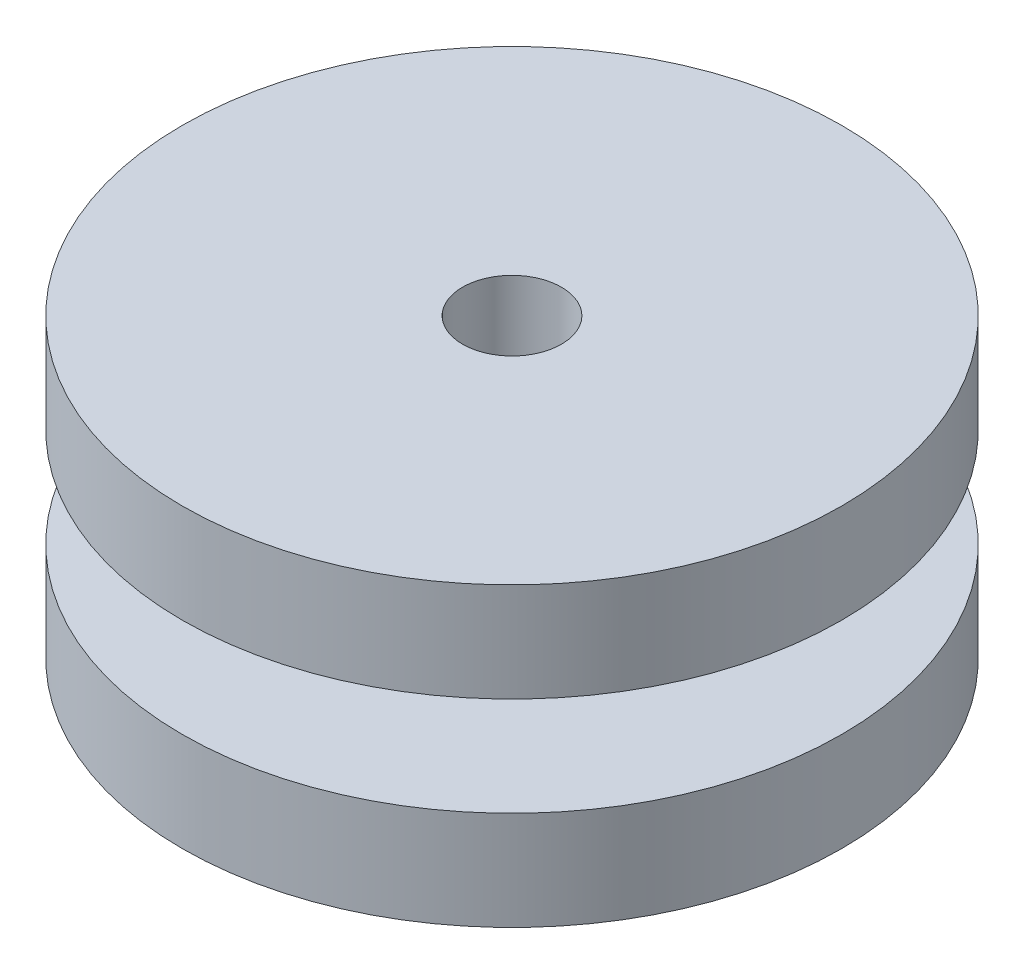
ISO-10303-21;
HEADER;
FILE_DESCRIPTION(('STEP AP214'),'2;1');
FILE_NAME('part.step','',(''),(''),'','','');
FILE_SCHEMA(('AUTOMOTIVE_DESIGN { 1 0 10303 214 1 1 1 1 }'));
ENDSEC;
DATA;
#1=APPLICATION_CONTEXT('core data for automotive mechanical design processes');
#2=APPLICATION_PROTOCOL_DEFINITION('international standard','automotive_design',2000,#1);
#3=PRODUCT_CONTEXT('',#1,'mechanical');
#4=PRODUCT('Part','Part','',(#3));
#5=PRODUCT_RELATED_PRODUCT_CATEGORY('part','',(#4));
#6=PRODUCT_DEFINITION_FORMATION('','',#4);
#7=PRODUCT_DEFINITION_CONTEXT('part definition',#1,'design');
#8=PRODUCT_DEFINITION('design','',#6,#7);
#9=PRODUCT_DEFINITION_SHAPE('','',#8);
#10=(LENGTH_UNIT() NAMED_UNIT(*) SI_UNIT(.MILLI.,.METRE.));
#11=(NAMED_UNIT(*) PLANE_ANGLE_UNIT() SI_UNIT($,.RADIAN.));
#12=(NAMED_UNIT(*) SI_UNIT($,.STERADIAN.) SOLID_ANGLE_UNIT());
#13=UNCERTAINTY_MEASURE_WITH_UNIT(LENGTH_MEASURE(1.E-05),#10,'distance_accuracy_value','');
#14=(GEOMETRIC_REPRESENTATION_CONTEXT(3) GLOBAL_UNCERTAINTY_ASSIGNED_CONTEXT((#13)) GLOBAL_UNIT_ASSIGNED_CONTEXT((#10,
#11,#12)) REPRESENTATION_CONTEXT('',''));
#15=CARTESIAN_POINT('',(0.,0.,0.));
#16=DIRECTION('',(0.,0.,1.));
#17=DIRECTION('',(1.,0.,0.));
#18=AXIS2_PLACEMENT_3D('',#15,#16,#17);
#19=CARTESIAN_POINT('',(0.,9.,0.));
#20=DIRECTION('',(0.,-1.,0.));
#21=DIRECTION('',(0.,0.,-1.));
#22=AXIS2_PLACEMENT_3D('',#19,#20,#21);
#23=CYLINDRICAL_SURFACE('',#22,3.5);
#24=CARTESIAN_POINT('',(0.,4.,0.));
#25=DIRECTION('',(0.,-1.,0.));
#26=DIRECTION('',(0.,0.,-1.));
#27=AXIS2_PLACEMENT_3D('',#24,#25,#26);
#28=CIRCLE('',#27,3.5);
#29=CARTESIAN_POINT('',(0.,4.,-3.5));
#30=VERTEX_POINT('',#29);
#31=EDGE_CURVE('E79',#30,#30,#28,.F.);
#32=ORIENTED_EDGE('',*,*,#31,.T.);
#33=EDGE_LOOP('',(#32));
#34=FACE_BOUND('',#33,.T.);
#35=CARTESIAN_POINT('',(0.,5.,0.));
#36=DIRECTION('',(0.,1.,0.));
#37=DIRECTION('',(0.,0.,1.));
#38=AXIS2_PLACEMENT_3D('',#35,#36,#37);
#39=CIRCLE('',#38,3.5);
#40=CARTESIAN_POINT('',(0.,5.,3.5));
#41=VERTEX_POINT('',#40);
#42=EDGE_CURVE('E84',#41,#41,#39,.F.);
#43=ORIENTED_EDGE('',*,*,#42,.T.);
#44=EDGE_LOOP('',(#43));
#45=FACE_BOUND('',#44,.T.);
#46=ADVANCED_FACE('F71',(#34,#45),#23,.T.);
#47=CARTESIAN_POINT('',(0.,9.,0.));
#48=DIRECTION('',(0.,1.,0.));
#49=DIRECTION('',(0.,0.,1.));
#50=AXIS2_PLACEMENT_3D('',#47,#48,#49);
#51=PLANE('',#50);
#52=CARTESIAN_POINT('',(0.,9.,0.));
#53=DIRECTION('',(0.,1.,0.));
#54=DIRECTION('',(0.,0.,1.));
#55=AXIS2_PLACEMENT_3D('',#52,#53,#54);
#56=CIRCLE('',#55,1.5);
#57=CARTESIAN_POINT('',(0.,9.,1.5));
#58=VERTEX_POINT('',#57);
#59=EDGE_CURVE('E95',#58,#58,#56,.T.);
#60=ORIENTED_EDGE('',*,*,#59,.F.);
#61=EDGE_LOOP('',(#60));
#62=FACE_BOUND('',#61,.T.);
#63=CARTESIAN_POINT('',(0.,9.,0.));
#64=DIRECTION('',(0.,1.,0.));
#65=DIRECTION('',(0.,0.,1.));
#66=AXIS2_PLACEMENT_3D('',#63,#64,#65);
#67=CIRCLE('',#66,10.);
#68=CARTESIAN_POINT('',(0.,9.,10.));
#69=VERTEX_POINT('',#68);
#70=EDGE_CURVE('E112',#69,#69,#67,.T.);
#71=ORIENTED_EDGE('',*,*,#70,.T.);
#72=EDGE_LOOP('',(#71));
#73=FACE_BOUND('',#72,.T.);
#74=ADVANCED_FACE('F141',(#62,#73),#51,.T.);
#75=CARTESIAN_POINT('',(0.,0.,0.));
#76=DIRECTION('',(0.,1.,0.));
#77=DIRECTION('',(0.,0.,1.));
#78=AXIS2_PLACEMENT_3D('',#75,#76,#77);
#79=PLANE('',#78);
#80=CARTESIAN_POINT('',(0.,0.,0.));
#81=DIRECTION('',(0.,1.,0.));
#82=DIRECTION('',(0.,0.,1.));
#83=AXIS2_PLACEMENT_3D('',#80,#81,#82);
#84=CIRCLE('',#83,1.5);
#85=CARTESIAN_POINT('',(0.,0.,1.5));
#86=VERTEX_POINT('',#85);
#87=EDGE_CURVE('E96',#86,#86,#84,.T.);
#88=ORIENTED_EDGE('',*,*,#87,.T.);
#89=EDGE_LOOP('',(#88));
#90=FACE_BOUND('',#89,.T.);
#91=CARTESIAN_POINT('',(0.,0.,0.));
#92=DIRECTION('',(0.,-1.,0.));
#93=DIRECTION('',(0.,0.,-1.));
#94=AXIS2_PLACEMENT_3D('',#91,#92,#93);
#95=CIRCLE('',#94,10.);
#96=CARTESIAN_POINT('',(0.,0.,-10.));
#97=VERTEX_POINT('',#96);
#98=EDGE_CURVE('E104',#97,#97,#95,.T.);
#99=ORIENTED_EDGE('',*,*,#98,.T.);
#100=EDGE_LOOP('',(#99));
#101=FACE_BOUND('',#100,.T.);
#102=ADVANCED_FACE('F137',(#90,#101),#79,.F.);
#103=CARTESIAN_POINT('',(0.,9.,0.));
#104=DIRECTION('',(0.,-1.,0.));
#105=DIRECTION('',(0.,0.,-1.));
#106=AXIS2_PLACEMENT_3D('',#103,#104,#105);
#107=CYLINDRICAL_SURFACE('',#106,1.5);
#108=ORIENTED_EDGE('',*,*,#59,.T.);
#109=EDGE_LOOP('',(#108));
#110=FACE_BOUND('',#109,.T.);
#111=ORIENTED_EDGE('',*,*,#87,.F.);
#112=EDGE_LOOP('',(#111));
#113=FACE_BOUND('',#112,.T.);
#114=ADVANCED_FACE('F126',(#110,#113),#107,.F.);
#115=CARTESIAN_POINT('',(0.,6.,0.));
#116=DIRECTION('',(0.,1.,0.));
#117=DIRECTION('',(0.,0.,1.));
#118=AXIS2_PLACEMENT_3D('',#115,#116,#117);
#119=PLANE('',#118);
#120=CARTESIAN_POINT('',(0.,6.,0.));
#121=DIRECTION('',(0.,1.,0.));
#122=DIRECTION('',(0.,0.,1.));
#123=AXIS2_PLACEMENT_3D('',#120,#121,#122);
#124=CIRCLE('',#123,4.5);
#125=CARTESIAN_POINT('',(0.,6.,4.5));
#126=VERTEX_POINT('',#125);
#127=EDGE_CURVE('E11',#126,#126,#124,.T.);
#128=ORIENTED_EDGE('',*,*,#127,.T.);
#129=EDGE_LOOP('',(#128));
#130=FACE_BOUND('',#129,.T.);
#131=CARTESIAN_POINT('',(0.,6.,0.));
#132=DIRECTION('',(0.,1.,0.));
#133=DIRECTION('',(0.,0.,1.));
#134=AXIS2_PLACEMENT_3D('',#131,#132,#133);
#135=CIRCLE('',#134,10.);
#136=CARTESIAN_POINT('',(0.,6.,10.));
#137=VERTEX_POINT('',#136);
#138=EDGE_CURVE('E108',#137,#137,#135,.T.);
#139=ORIENTED_EDGE('',*,*,#138,.F.);
#140=EDGE_LOOP('',(#139));
#141=FACE_BOUND('',#140,.T.);
#142=ADVANCED_FACE('F123',(#130,#141),#119,.F.);
#143=CARTESIAN_POINT('',(0.,3.,0.));
#144=DIRECTION('',(0.,-1.,0.));
#145=DIRECTION('',(0.,0.,-1.));
#146=AXIS2_PLACEMENT_3D('',#143,#144,#145);
#147=PLANE('',#146);
#148=CARTESIAN_POINT('',(0.,3.,0.));
#149=DIRECTION('',(0.,-1.,0.));
#150=DIRECTION('',(0.,0.,-1.));
#151=AXIS2_PLACEMENT_3D('',#148,#149,#150);
#152=CIRCLE('',#151,4.5);
#153=CARTESIAN_POINT('',(0.,3.,-4.5));
#154=VERTEX_POINT('',#153);
#155=EDGE_CURVE('E89',#154,#154,#152,.T.);
#156=ORIENTED_EDGE('',*,*,#155,.T.);
#157=EDGE_LOOP('',(#156));
#158=FACE_BOUND('',#157,.T.);
#159=CARTESIAN_POINT('',(0.,3.,0.));
#160=DIRECTION('',(0.,-1.,0.));
#161=DIRECTION('',(0.,0.,-1.));
#162=AXIS2_PLACEMENT_3D('',#159,#160,#161);
#163=CIRCLE('',#162,10.);
#164=CARTESIAN_POINT('',(0.,3.,-10.));
#165=VERTEX_POINT('',#164);
#166=EDGE_CURVE('E100',#165,#165,#163,.T.);
#167=ORIENTED_EDGE('',*,*,#166,.F.);
#168=EDGE_LOOP('',(#167));
#169=FACE_BOUND('',#168,.T.);
#170=ADVANCED_FACE('F125',(#158,#169),#147,.F.);
#171=CARTESIAN_POINT('',(0.,4.,0.));
#172=DIRECTION('',(0.,-1.,0.));
#173=DIRECTION('',(0.,0.,-1.));
#174=AXIS2_PLACEMENT_3D('',#171,#172,#173);
#175=TOROIDAL_SURFACE('',#174,4.5,1.);
#176=ORIENTED_EDGE('',*,*,#31,.F.);
#177=EDGE_LOOP('',(#176));
#178=FACE_BOUND('',#177,.T.);
#179=ORIENTED_EDGE('',*,*,#155,.F.);
#180=EDGE_LOOP('',(#179));
#181=FACE_BOUND('',#180,.T.);
#182=ADVANCED_FACE('F133',(#178,#181),#175,.F.);
#183=CARTESIAN_POINT('',(0.,5.,0.));
#184=DIRECTION('',(0.,1.,0.));
#185=DIRECTION('',(0.,0.,1.));
#186=AXIS2_PLACEMENT_3D('',#183,#184,#185);
#187=TOROIDAL_SURFACE('',#186,4.5,1.);
#188=ORIENTED_EDGE('',*,*,#42,.F.);
#189=EDGE_LOOP('',(#188));
#190=FACE_BOUND('',#189,.T.);
#191=ORIENTED_EDGE('',*,*,#127,.F.);
#192=EDGE_LOOP('',(#191));
#193=FACE_BOUND('',#192,.T.);
#194=ADVANCED_FACE('F73',(#190,#193),#187,.F.);
#195=CARTESIAN_POINT('',(0.,3.,0.));
#196=DIRECTION('',(0.,-1.,0.));
#197=DIRECTION('',(0.,0.,-1.));
#198=AXIS2_PLACEMENT_3D('',#195,#196,#197);
#199=CYLINDRICAL_SURFACE('',#198,10.);
#200=ORIENTED_EDGE('',*,*,#166,.T.);
#201=EDGE_LOOP('',(#200));
#202=FACE_BOUND('',#201,.T.);
#203=ORIENTED_EDGE('',*,*,#98,.F.);
#204=EDGE_LOOP('',(#203));
#205=FACE_BOUND('',#204,.T.);
#206=ADVANCED_FACE('F155',(#202,#205),#199,.T.);
#207=CARTESIAN_POINT('',(0.,6.,0.));
#208=DIRECTION('',(0.,1.,0.));
#209=DIRECTION('',(0.,0.,1.));
#210=AXIS2_PLACEMENT_3D('',#207,#208,#209);
#211=CYLINDRICAL_SURFACE('',#210,10.);
#212=ORIENTED_EDGE('',*,*,#138,.T.);
#213=EDGE_LOOP('',(#212));
#214=FACE_BOUND('',#213,.T.);
#215=ORIENTED_EDGE('',*,*,#70,.F.);
#216=EDGE_LOOP('',(#215));
#217=FACE_BOUND('',#216,.T.);
#218=ADVANCED_FACE('F120',(#214,#217),#211,.T.);
#219=CLOSED_SHELL('',(#46,#74,#102,#114,#142,#170,#182,#194,#206,#218));
#220=MANIFOLD_SOLID_BREP('B2',#219);
#221=ADVANCED_BREP_SHAPE_REPRESENTATION('',(#18,#220),#14);
#222=SHAPE_DEFINITION_REPRESENTATION(#9,#221);
ENDSEC;
END-ISO-10303-21;
